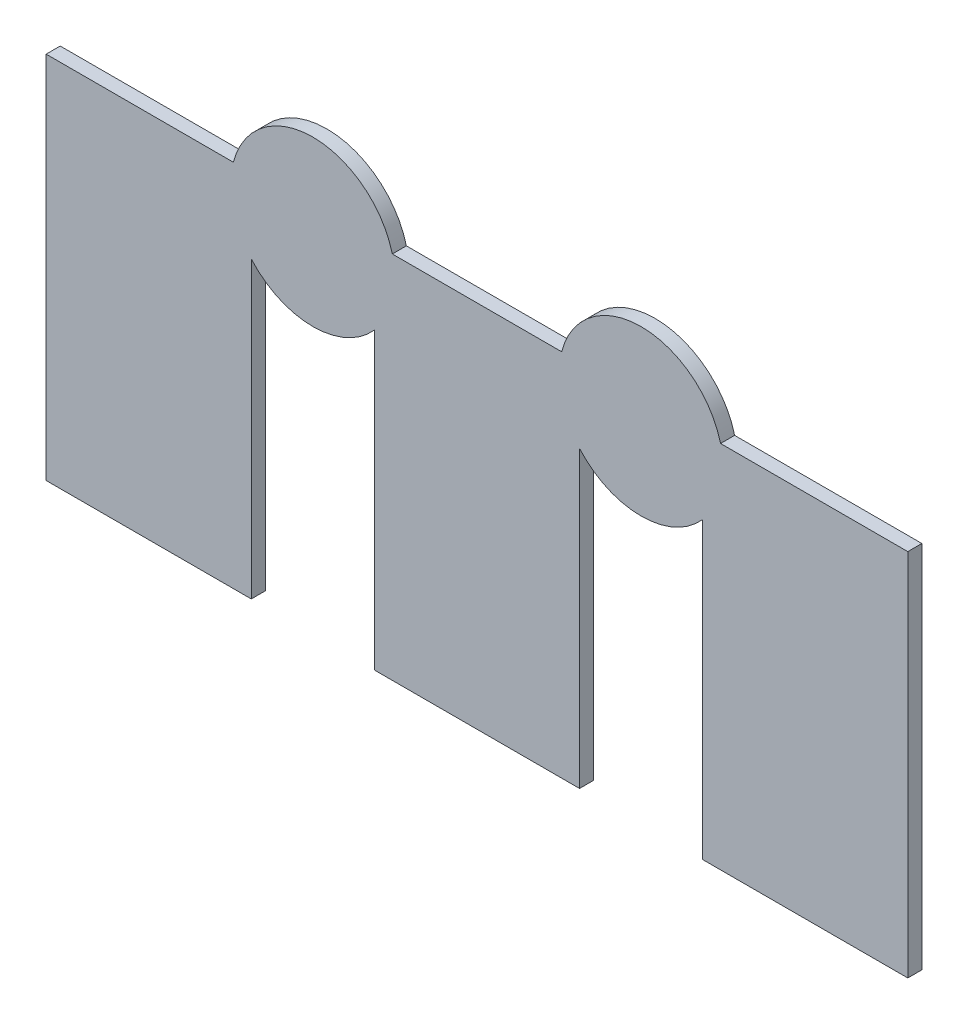
ISO-10303-21;
HEADER;
FILE_DESCRIPTION(('STEP AP214'),'2;1');
FILE_NAME('part.step','',(''),(''),'','','');
FILE_SCHEMA(('AUTOMOTIVE_DESIGN { 1 0 10303 214 1 1 1 1 }'));
ENDSEC;
DATA;
#1=APPLICATION_CONTEXT('core data for automotive mechanical design processes');
#2=APPLICATION_PROTOCOL_DEFINITION('international standard','automotive_design',2000,#1);
#3=PRODUCT_CONTEXT('',#1,'mechanical');
#4=PRODUCT('Part','Part','',(#3));
#5=PRODUCT_RELATED_PRODUCT_CATEGORY('part','',(#4));
#6=PRODUCT_DEFINITION_FORMATION('','',#4);
#7=PRODUCT_DEFINITION_CONTEXT('part definition',#1,'design');
#8=PRODUCT_DEFINITION('design','',#6,#7);
#9=PRODUCT_DEFINITION_SHAPE('','',#8);
#10=(LENGTH_UNIT() NAMED_UNIT(*) SI_UNIT(.MILLI.,.METRE.));
#11=(NAMED_UNIT(*) PLANE_ANGLE_UNIT() SI_UNIT($,.RADIAN.));
#12=(NAMED_UNIT(*) SI_UNIT($,.STERADIAN.) SOLID_ANGLE_UNIT());
#13=UNCERTAINTY_MEASURE_WITH_UNIT(LENGTH_MEASURE(1.E-05),#10,'distance_accuracy_value','');
#14=(GEOMETRIC_REPRESENTATION_CONTEXT(3) GLOBAL_UNCERTAINTY_ASSIGNED_CONTEXT((#13)) GLOBAL_UNIT_ASSIGNED_CONTEXT((#10,
#11,#12)) REPRESENTATION_CONTEXT('',''));
#15=CARTESIAN_POINT('',(0.,0.,0.));
#16=DIRECTION('',(0.,0.,1.));
#17=DIRECTION('',(1.,0.,0.));
#18=AXIS2_PLACEMENT_3D('',#15,#16,#17);
#19=CARTESIAN_POINT('',(4.200079999771,10.541256410265,0.));
#20=DIRECTION('',(0.,0.,-1.));
#21=DIRECTION('',(-1.,0.,0.));
#22=AXIS2_PLACEMENT_3D('',#19,#20,#21);
#23=PLANE('',#22);
#24=DIRECTION('',(1.,0.,0.));
#25=VECTOR('',#24,1.);
#26=CARTESIAN_POINT('',(4.793754643,10.95,0.));
#27=LINE('',#26,#25);
#28=CARTESIAN_POINT('',(4.79375464300021,10.95,0.));
#29=VERTEX_POINT('',#28);
#30=CARTESIAN_POINT('',(5.25008,10.95,0.));
#31=VERTEX_POINT('',#30);
#32=EDGE_CURVE('E93',#29,#31,#27,.T.);
#33=ORIENTED_EDGE('',*,*,#32,.T.);
#34=DIRECTION('',(0.,1.,0.));
#35=VECTOR('',#34,1.);
#36=CARTESIAN_POINT('',(5.25008,10.95,0.));
#37=LINE('',#36,#35);
#38=CARTESIAN_POINT('',(5.25008,10.05,0.));
#39=VERTEX_POINT('',#38);
#40=EDGE_CURVE('E112',#31,#39,#37,.F.);
#41=ORIENTED_EDGE('',*,*,#40,.T.);
#42=DIRECTION('',(1.,0.,0.));
#43=VECTOR('',#42,1.);
#44=CARTESIAN_POINT('',(5.25008,10.05,0.));
#45=LINE('',#44,#43);
#46=CARTESIAN_POINT('',(4.75008,10.05,0.));
#47=VERTEX_POINT('',#46);
#48=EDGE_CURVE('E107',#39,#47,#45,.F.);
#49=ORIENTED_EDGE('',*,*,#48,.T.);
#50=DIRECTION('',(0.,1.,0.));
#51=VECTOR('',#50,1.);
#52=CARTESIAN_POINT('',(4.75008,10.05,0.));
#53=LINE('',#52,#51);
#54=CARTESIAN_POINT('',(4.75008,10.7676751440001,0.));
#55=VERTEX_POINT('',#54);
#56=EDGE_CURVE('E111',#47,#55,#53,.T.);
#57=ORIENTED_EDGE('',*,*,#56,.T.);
#58=CARTESIAN_POINT('',(4.60008,10.899999999596,0.));
#59=DIRECTION('',(0.,0.,1.));
#60=DIRECTION('',(1.,0.,0.));
#61=AXIS2_PLACEMENT_3D('',#58,#59,#60);
#62=CIRCLE('',#61,0.200024667);
#63=CARTESIAN_POINT('',(4.45008000000004,10.7676751440001,0.));
#64=VERTEX_POINT('',#63);
#65=EDGE_CURVE('E124',#64,#55,#62,.T.);
#66=ORIENTED_EDGE('',*,*,#65,.F.);
#67=DIRECTION('',(0.,1.,0.));
#68=VECTOR('',#67,1.);
#69=CARTESIAN_POINT('',(4.45008,10.767675144,0.));
#70=LINE('',#69,#68);
#71=CARTESIAN_POINT('',(4.45008,10.05,0.));
#72=VERTEX_POINT('',#71);
#73=EDGE_CURVE('E137',#64,#72,#70,.F.);
#74=ORIENTED_EDGE('',*,*,#73,.T.);
#75=DIRECTION('',(1.,0.,0.));
#76=VECTOR('',#75,1.);
#77=CARTESIAN_POINT('',(4.45008,10.05,0.));
#78=LINE('',#77,#76);
#79=CARTESIAN_POINT('',(3.95008,10.05,0.));
#80=VERTEX_POINT('',#79);
#81=EDGE_CURVE('E144',#72,#80,#78,.F.);
#82=ORIENTED_EDGE('',*,*,#81,.T.);
#83=DIRECTION('',(0.,1.,0.));
#84=VECTOR('',#83,1.);
#85=CARTESIAN_POINT('',(3.95008,10.05,0.));
#86=LINE('',#85,#84);
#87=CARTESIAN_POINT('',(3.95008,10.7676751510001,0.));
#88=VERTEX_POINT('',#87);
#89=EDGE_CURVE('E150',#80,#88,#86,.T.);
#90=ORIENTED_EDGE('',*,*,#89,.T.);
#91=CARTESIAN_POINT('',(3.80008,10.900000006596,0.));
#92=DIRECTION('',(0.,0.,1.));
#93=DIRECTION('',(1.,0.,0.));
#94=AXIS2_PLACEMENT_3D('',#91,#92,#93);
#95=CIRCLE('',#94,0.200024667);
#96=CARTESIAN_POINT('',(3.65008000000004,10.7676751510001,0.));
#97=VERTEX_POINT('',#96);
#98=EDGE_CURVE('E152',#97,#88,#95,.T.);
#99=ORIENTED_EDGE('',*,*,#98,.F.);
#100=DIRECTION('',(0.,1.,0.));
#101=VECTOR('',#100,1.);
#102=CARTESIAN_POINT('',(3.65008,10.767675151,0.));
#103=LINE('',#102,#101);
#104=CARTESIAN_POINT('',(3.65008,10.05,0.));
#105=VERTEX_POINT('',#104);
#106=EDGE_CURVE('E155',#97,#105,#103,.F.);
#107=ORIENTED_EDGE('',*,*,#106,.T.);
#108=DIRECTION('',(1.,0.,0.));
#109=VECTOR('',#108,1.);
#110=CARTESIAN_POINT('',(3.65008,10.05,0.));
#111=LINE('',#110,#109);
#112=CARTESIAN_POINT('',(3.15008,10.05,0.));
#113=VERTEX_POINT('',#112);
#114=EDGE_CURVE('E162',#105,#113,#111,.F.);
#115=ORIENTED_EDGE('',*,*,#114,.T.);
#116=DIRECTION('',(0.,1.,0.));
#117=VECTOR('',#116,1.);
#118=CARTESIAN_POINT('',(3.15008,10.05,0.));
#119=LINE('',#118,#117);
#120=CARTESIAN_POINT('',(3.15008,10.95,0.));
#121=VERTEX_POINT('',#120);
#122=EDGE_CURVE('E168',#113,#121,#119,.T.);
#123=ORIENTED_EDGE('',*,*,#122,.T.);
#124=DIRECTION('',(1.,8.765680075471E-09,0.));
#125=VECTOR('',#124,1.);
#126=CARTESIAN_POINT('',(3.15008,10.95,0.));
#127=LINE('',#126,#125);
#128=CARTESIAN_POINT('',(3.60640535899979,10.950000004,0.));
#129=VERTEX_POINT('',#128);
#130=EDGE_CURVE('E174',#121,#129,#127,.T.);
#131=ORIENTED_EDGE('',*,*,#130,.T.);
#132=CARTESIAN_POINT('',(3.800079999967,10.899999995454,0.));
#133=DIRECTION('',(0.,0.,1.));
#134=DIRECTION('',(1.,0.,0.));
#135=AXIS2_PLACEMENT_3D('',#132,#133,#134);
#136=CIRCLE('',#135,0.200024667);
#137=CARTESIAN_POINT('',(3.99375464203164,10.94999999975,0.));
#138=VERTEX_POINT('',#137);
#139=EDGE_CURVE('E176',#138,#129,#136,.T.);
#140=ORIENTED_EDGE('',*,*,#139,.F.);
#141=DIRECTION('',(1.,1.029912388186E-08,0.));
#142=VECTOR('',#141,1.);
#143=CARTESIAN_POINT('',(3.993754642032,10.94999999975,0.));
#144=LINE('',#143,#142);
#145=CARTESIAN_POINT('',(4.40640535800021,10.9500000039999,0.));
#146=VERTEX_POINT('',#145);
#147=EDGE_CURVE('E179',#138,#146,#144,.T.);
#148=ORIENTED_EDGE('',*,*,#147,.T.);
#149=CARTESIAN_POINT('',(4.600079999984,10.89999999939,0.));
#150=DIRECTION('',(0.,0.,1.));
#151=DIRECTION('',(1.,0.,0.));
#152=AXIS2_PLACEMENT_3D('',#149,#150,#151);
#153=CIRCLE('',#152,0.200024667);
#154=EDGE_CURVE('E20',#29,#146,#153,.T.);
#155=ORIENTED_EDGE('',*,*,#154,.F.);
#156=EDGE_LOOP('',(#33,#41,#49,#57,#66,#74,#82,#90,#99,#107,#115,#123,#131,#140,#148,#155));
#157=FACE_BOUND('',#156,.T.);
#158=ADVANCED_FACE('F17',(#157),#23,.T.);
#159=CARTESIAN_POINT('',(5.25008,10.05,0.));
#160=DIRECTION('',(0.,1.,0.));
#161=DIRECTION('',(0.,0.,1.));
#162=AXIS2_PLACEMENT_3D('',#159,#160,#161);
#163=PLANE('',#162);
#164=DIRECTION('',(0.,0.,-1.));
#165=VECTOR('',#164,1.);
#166=CARTESIAN_POINT('',(4.75008,10.05,0.));
#167=LINE('',#166,#165);
#168=CARTESIAN_POINT('',(4.75008,10.05,0.03429));
#169=VERTEX_POINT('',#168);
#170=EDGE_CURVE('E119',#169,#47,#167,.T.);
#171=ORIENTED_EDGE('',*,*,#170,.T.);
#172=ORIENTED_EDGE('',*,*,#48,.F.);
#173=DIRECTION('',(0.,0.,1.));
#174=VECTOR('',#173,1.);
#175=CARTESIAN_POINT('',(5.25008,10.05,0.));
#176=LINE('',#175,#174);
#177=CARTESIAN_POINT('',(5.25008,10.05,0.03429));
#178=VERTEX_POINT('',#177);
#179=EDGE_CURVE('E184',#39,#178,#176,.T.);
#180=ORIENTED_EDGE('',*,*,#179,.T.);
#181=DIRECTION('',(1.,0.,0.));
#182=VECTOR('',#181,1.);
#183=CARTESIAN_POINT('',(4.200079999771,10.05,0.03429));
#184=LINE('',#183,#182);
#185=EDGE_CURVE('E122',#169,#178,#184,.T.);
#186=ORIENTED_EDGE('',*,*,#185,.F.);
#187=EDGE_LOOP('',(#171,#172,#180,#186));
#188=FACE_BOUND('',#187,.T.);
#189=ADVANCED_FACE('F120',(#188),#163,.F.);
#190=CARTESIAN_POINT('',(5.25008,10.95,0.));
#191=DIRECTION('',(-1.,0.,0.));
#192=DIRECTION('',(0.,0.,1.));
#193=AXIS2_PLACEMENT_3D('',#190,#191,#192);
#194=PLANE('',#193);
#195=ORIENTED_EDGE('',*,*,#179,.F.);
#196=ORIENTED_EDGE('',*,*,#40,.F.);
#197=DIRECTION('',(0.,0.,-1.));
#198=VECTOR('',#197,1.);
#199=CARTESIAN_POINT('',(5.25008,10.95,0.));
#200=LINE('',#199,#198);
#201=CARTESIAN_POINT('',(5.25008,10.95,0.03429));
#202=VERTEX_POINT('',#201);
#203=EDGE_CURVE('E183',#31,#202,#200,.F.);
#204=ORIENTED_EDGE('',*,*,#203,.T.);
#205=DIRECTION('',(0.,1.,0.));
#206=VECTOR('',#205,1.);
#207=CARTESIAN_POINT('',(5.25008,10.541256410265,0.03429));
#208=LINE('',#207,#206);
#209=EDGE_CURVE('E230',#178,#202,#208,.T.);
#210=ORIENTED_EDGE('',*,*,#209,.F.);
#211=EDGE_LOOP('',(#195,#196,#204,#210));
#212=FACE_BOUND('',#211,.T.);
#213=ADVANCED_FACE('F236',(#212),#194,.F.);
#214=CARTESIAN_POINT('',(4.793754643,10.95,0.));
#215=DIRECTION('',(0.,-1.,0.));
#216=DIRECTION('',(0.,0.,-1.));
#217=AXIS2_PLACEMENT_3D('',#214,#215,#216);
#218=PLANE('',#217);
#219=ORIENTED_EDGE('',*,*,#203,.F.);
#220=ORIENTED_EDGE('',*,*,#32,.F.);
#221=DIRECTION('',(0.,0.,1.));
#222=VECTOR('',#221,1.);
#223=CARTESIAN_POINT('',(4.79375464300021,10.9500000000001,0.));
#224=LINE('',#223,#222);
#225=CARTESIAN_POINT('',(4.79375464300021,10.95,0.03429));
#226=VERTEX_POINT('',#225);
#227=EDGE_CURVE('E223',#226,#29,#224,.F.);
#228=ORIENTED_EDGE('',*,*,#227,.F.);
#229=DIRECTION('',(1.,0.,0.));
#230=VECTOR('',#229,1.);
#231=CARTESIAN_POINT('',(4.200079999771,10.95,0.03429));
#232=LINE('',#231,#230);
#233=EDGE_CURVE('E206',#202,#226,#232,.F.);
#234=ORIENTED_EDGE('',*,*,#233,.F.);
#235=EDGE_LOOP('',(#219,#220,#228,#234));
#236=FACE_BOUND('',#235,.T.);
#237=ADVANCED_FACE('F311',(#236),#218,.F.);
#238=CARTESIAN_POINT('',(4.600079999984,10.89999999939,0.));
#239=DIRECTION('',(0.,0.,1.));
#240=DIRECTION('',(1.,0.,0.));
#241=AXIS2_PLACEMENT_3D('',#238,#239,#240);
#242=CYLINDRICAL_SURFACE('',#241,0.200024667);
#243=ORIENTED_EDGE('',*,*,#154,.T.);
#244=DIRECTION('',(0.,0.,1.));
#245=VECTOR('',#244,1.);
#246=CARTESIAN_POINT('',(4.406405358,10.9500000039999,0.));
#247=LINE('',#246,#245);
#248=CARTESIAN_POINT('',(4.40640535800022,10.950000004,0.03429));
#249=VERTEX_POINT('',#248);
#250=EDGE_CURVE('E181',#146,#249,#247,.T.);
#251=ORIENTED_EDGE('',*,*,#250,.T.);
#252=CARTESIAN_POINT('',(4.600079999984,10.89999999939,0.03429));
#253=DIRECTION('',(0.,0.,1.));
#254=DIRECTION('',(1.,0.,0.));
#255=AXIS2_PLACEMENT_3D('',#252,#253,#254);
#256=CIRCLE('',#255,0.200024667);
#257=EDGE_CURVE('E203',#226,#249,#256,.T.);
#258=ORIENTED_EDGE('',*,*,#257,.F.);
#259=ORIENTED_EDGE('',*,*,#227,.T.);
#260=EDGE_LOOP('',(#243,#251,#258,#259));
#261=FACE_BOUND('',#260,.T.);
#262=ADVANCED_FACE('F464',(#261),#242,.T.);
#263=CARTESIAN_POINT('',(3.993754642032,10.94999999975,0.));
#264=DIRECTION('',(1.029912388186E-08,-1.,0.));
#265=DIRECTION('',(1.,1.029912388186E-08,0.));
#266=AXIS2_PLACEMENT_3D('',#263,#264,#265);
#267=PLANE('',#266);
#268=ORIENTED_EDGE('',*,*,#250,.F.);
#269=ORIENTED_EDGE('',*,*,#147,.F.);
#270=DIRECTION('',(0.,0.,1.));
#271=VECTOR('',#270,1.);
#272=CARTESIAN_POINT('',(3.99375464203165,10.9499999997499,0.));
#273=LINE('',#272,#271);
#274=CARTESIAN_POINT('',(3.99375464148304,10.950000001875,0.03429));
#275=VERTEX_POINT('',#274);
#276=EDGE_CURVE('E212',#275,#138,#273,.F.);
#277=ORIENTED_EDGE('',*,*,#276,.F.);
#278=DIRECTION('',(1.,0.,0.));
#279=VECTOR('',#278,1.);
#280=CARTESIAN_POINT('',(4.200079999771,10.950000004,0.03429));
#281=LINE('',#280,#279);
#282=EDGE_CURVE('E202',#249,#275,#281,.F.);
#283=ORIENTED_EDGE('',*,*,#282,.F.);
#284=EDGE_LOOP('',(#268,#269,#277,#283));
#285=FACE_BOUND('',#284,.T.);
#286=ADVANCED_FACE('F455',(#285),#267,.F.);
#287=CARTESIAN_POINT('',(3.800079999967,10.899999995454,0.));
#288=DIRECTION('',(0.,0.,1.));
#289=DIRECTION('',(1.,0.,0.));
#290=AXIS2_PLACEMENT_3D('',#287,#288,#289);
#291=CYLINDRICAL_SURFACE('',#290,0.200024667);
#292=ORIENTED_EDGE('',*,*,#139,.T.);
#293=DIRECTION('',(0.,0.,1.));
#294=VECTOR('',#293,1.);
#295=CARTESIAN_POINT('',(3.606405359,10.950000004,0.));
#296=LINE('',#295,#294);
#297=CARTESIAN_POINT('',(3.60640535899979,10.950000004,0.03429));
#298=VERTEX_POINT('',#297);
#299=EDGE_CURVE('E171',#129,#298,#296,.T.);
#300=ORIENTED_EDGE('',*,*,#299,.T.);
#301=CARTESIAN_POINT('',(3.800079999967,10.899999995454,0.03429));
#302=DIRECTION('',(0.,0.,1.));
#303=DIRECTION('',(1.,0.,0.));
#304=AXIS2_PLACEMENT_3D('',#301,#302,#303);
#305=CIRCLE('',#304,0.200024667);
#306=EDGE_CURVE('E198',#275,#298,#305,.T.);
#307=ORIENTED_EDGE('',*,*,#306,.F.);
#308=ORIENTED_EDGE('',*,*,#276,.T.);
#309=EDGE_LOOP('',(#292,#300,#307,#308));
#310=FACE_BOUND('',#309,.T.);
#311=ADVANCED_FACE('F446',(#310),#291,.T.);
#312=CARTESIAN_POINT('',(3.15008,10.95,0.));
#313=DIRECTION('',(8.765680075471E-09,-1.,0.));
#314=DIRECTION('',(1.,8.765680075471E-09,0.));
#315=AXIS2_PLACEMENT_3D('',#312,#313,#314);
#316=PLANE('',#315);
#317=ORIENTED_EDGE('',*,*,#299,.F.);
#318=ORIENTED_EDGE('',*,*,#130,.F.);
#319=DIRECTION('',(0.,0.,-1.));
#320=VECTOR('',#319,1.);
#321=CARTESIAN_POINT('',(3.15008,10.95,0.));
#322=LINE('',#321,#320);
#323=CARTESIAN_POINT('',(3.15008,10.9500000026667,0.03429));
#324=VERTEX_POINT('',#323);
#325=EDGE_CURVE('E165',#121,#324,#322,.F.);
#326=ORIENTED_EDGE('',*,*,#325,.T.);
#327=DIRECTION('',(1.,0.,0.));
#328=VECTOR('',#327,1.);
#329=CARTESIAN_POINT('',(4.200079999771,10.950000004,0.03429));
#330=LINE('',#329,#328);
#331=EDGE_CURVE('E201',#298,#324,#330,.F.);
#332=ORIENTED_EDGE('',*,*,#331,.F.);
#333=EDGE_LOOP('',(#317,#318,#326,#332));
#334=FACE_BOUND('',#333,.T.);
#335=ADVANCED_FACE('F290',(#334),#316,.F.);
#336=CARTESIAN_POINT('',(3.15008,10.05,0.));
#337=DIRECTION('',(1.,0.,0.));
#338=DIRECTION('',(0.,0.,-1.));
#339=AXIS2_PLACEMENT_3D('',#336,#337,#338);
#340=PLANE('',#339);
#341=ORIENTED_EDGE('',*,*,#325,.F.);
#342=ORIENTED_EDGE('',*,*,#122,.F.);
#343=DIRECTION('',(0.,0.,1.));
#344=VECTOR('',#343,1.);
#345=CARTESIAN_POINT('',(3.15008,10.05,0.));
#346=LINE('',#345,#344);
#347=CARTESIAN_POINT('',(3.15008,10.05,0.03429));
#348=VERTEX_POINT('',#347);
#349=EDGE_CURVE('E159',#113,#348,#346,.T.);
#350=ORIENTED_EDGE('',*,*,#349,.T.);
#351=DIRECTION('',(0.,1.,0.));
#352=VECTOR('',#351,1.);
#353=CARTESIAN_POINT('',(3.15008,10.541256410265,0.03429));
#354=LINE('',#353,#352);
#355=EDGE_CURVE('E272',#324,#348,#354,.F.);
#356=ORIENTED_EDGE('',*,*,#355,.F.);
#357=EDGE_LOOP('',(#341,#342,#350,#356));
#358=FACE_BOUND('',#357,.T.);
#359=ADVANCED_FACE('F296',(#358),#340,.F.);
#360=CARTESIAN_POINT('',(3.65008,10.05,0.));
#361=DIRECTION('',(0.,1.,0.));
#362=DIRECTION('',(0.,0.,1.));
#363=AXIS2_PLACEMENT_3D('',#360,#361,#362);
#364=PLANE('',#363);
#365=ORIENTED_EDGE('',*,*,#349,.F.);
#366=ORIENTED_EDGE('',*,*,#114,.F.);
#367=DIRECTION('',(0.,0.,1.));
#368=VECTOR('',#367,1.);
#369=CARTESIAN_POINT('',(3.65008,10.05,0.));
#370=LINE('',#369,#368);
#371=CARTESIAN_POINT('',(3.65008,10.05,0.03429));
#372=VERTEX_POINT('',#371);
#373=EDGE_CURVE('E158',#105,#372,#370,.T.);
#374=ORIENTED_EDGE('',*,*,#373,.T.);
#375=DIRECTION('',(1.,0.,0.));
#376=VECTOR('',#375,1.);
#377=CARTESIAN_POINT('',(4.200079999771,10.05,0.03429));
#378=LINE('',#377,#376);
#379=EDGE_CURVE('E269',#348,#372,#378,.T.);
#380=ORIENTED_EDGE('',*,*,#379,.F.);
#381=EDGE_LOOP('',(#365,#366,#374,#380));
#382=FACE_BOUND('',#381,.T.);
#383=ADVANCED_FACE('F420',(#382),#364,.F.);
#384=CARTESIAN_POINT('',(3.65008,10.767675151,0.));
#385=DIRECTION('',(-1.,0.,0.));
#386=DIRECTION('',(0.,0.,1.));
#387=AXIS2_PLACEMENT_3D('',#384,#385,#386);
#388=PLANE('',#387);
#389=ORIENTED_EDGE('',*,*,#373,.F.);
#390=ORIENTED_EDGE('',*,*,#106,.F.);
#391=DIRECTION('',(0.,0.,1.));
#392=VECTOR('',#391,1.);
#393=CARTESIAN_POINT('',(3.65008000000008,10.7676751510001,0.));
#394=LINE('',#393,#392);
#395=CARTESIAN_POINT('',(3.65008000000004,10.7676751510001,0.03429));
#396=VERTEX_POINT('',#395);
#397=EDGE_CURVE('E210',#396,#97,#394,.F.);
#398=ORIENTED_EDGE('',*,*,#397,.F.);
#399=DIRECTION('',(0.,1.,0.));
#400=VECTOR('',#399,1.);
#401=CARTESIAN_POINT('',(3.65008,10.541256410265,0.03429));
#402=LINE('',#401,#400);
#403=EDGE_CURVE('E197',#372,#396,#402,.T.);
#404=ORIENTED_EDGE('',*,*,#403,.F.);
#405=EDGE_LOOP('',(#389,#390,#398,#404));
#406=FACE_BOUND('',#405,.T.);
#407=ADVANCED_FACE('F348',(#406),#388,.F.);
#408=CARTESIAN_POINT('',(3.80008,10.900000006596,0.));
#409=DIRECTION('',(0.,0.,1.));
#410=DIRECTION('',(1.,0.,0.));
#411=AXIS2_PLACEMENT_3D('',#408,#409,#410);
#412=CYLINDRICAL_SURFACE('',#411,0.200024667);
#413=ORIENTED_EDGE('',*,*,#98,.T.);
#414=DIRECTION('',(0.,0.,-1.));
#415=VECTOR('',#414,1.);
#416=CARTESIAN_POINT('',(3.95008,10.767675151,0.));
#417=LINE('',#416,#415);
#418=CARTESIAN_POINT('',(3.95008,10.7676751510001,0.03429));
#419=VERTEX_POINT('',#418);
#420=EDGE_CURVE('E147',#88,#419,#417,.F.);
#421=ORIENTED_EDGE('',*,*,#420,.T.);
#422=CARTESIAN_POINT('',(3.80008,10.900000006596,0.03429));
#423=DIRECTION('',(0.,0.,1.));
#424=DIRECTION('',(1.,0.,0.));
#425=AXIS2_PLACEMENT_3D('',#422,#423,#424);
#426=CIRCLE('',#425,0.200024667);
#427=EDGE_CURVE('E193',#396,#419,#426,.T.);
#428=ORIENTED_EDGE('',*,*,#427,.F.);
#429=ORIENTED_EDGE('',*,*,#397,.T.);
#430=EDGE_LOOP('',(#413,#421,#428,#429));
#431=FACE_BOUND('',#430,.T.);
#432=ADVANCED_FACE('F351',(#431),#412,.T.);
#433=CARTESIAN_POINT('',(3.95008,10.05,0.));
#434=DIRECTION('',(1.,0.,0.));
#435=DIRECTION('',(0.,0.,-1.));
#436=AXIS2_PLACEMENT_3D('',#433,#434,#435);
#437=PLANE('',#436);
#438=ORIENTED_EDGE('',*,*,#420,.F.);
#439=ORIENTED_EDGE('',*,*,#89,.F.);
#440=DIRECTION('',(0.,0.,1.));
#441=VECTOR('',#440,1.);
#442=CARTESIAN_POINT('',(3.95008,10.05,0.));
#443=LINE('',#442,#441);
#444=CARTESIAN_POINT('',(3.95008,10.05,0.03429));
#445=VERTEX_POINT('',#444);
#446=EDGE_CURVE('E141',#80,#445,#443,.T.);
#447=ORIENTED_EDGE('',*,*,#446,.T.);
#448=DIRECTION('',(0.,1.,0.));
#449=VECTOR('',#448,1.);
#450=CARTESIAN_POINT('',(3.95008,10.541256410265,0.03429));
#451=LINE('',#450,#449);
#452=EDGE_CURVE('E196',#419,#445,#451,.F.);
#453=ORIENTED_EDGE('',*,*,#452,.F.);
#454=EDGE_LOOP('',(#438,#439,#447,#453));
#455=FACE_BOUND('',#454,.T.);
#456=ADVANCED_FACE('F353',(#455),#437,.F.);
#457=CARTESIAN_POINT('',(4.45008,10.05,0.));
#458=DIRECTION('',(0.,1.,0.));
#459=DIRECTION('',(0.,0.,1.));
#460=AXIS2_PLACEMENT_3D('',#457,#458,#459);
#461=PLANE('',#460);
#462=ORIENTED_EDGE('',*,*,#446,.F.);
#463=ORIENTED_EDGE('',*,*,#81,.F.);
#464=DIRECTION('',(0.,0.,1.));
#465=VECTOR('',#464,1.);
#466=CARTESIAN_POINT('',(4.45008,10.05,0.));
#467=LINE('',#466,#465);
#468=CARTESIAN_POINT('',(4.45008,10.05,0.03429));
#469=VERTEX_POINT('',#468);
#470=EDGE_CURVE('E140',#72,#469,#467,.T.);
#471=ORIENTED_EDGE('',*,*,#470,.T.);
#472=DIRECTION('',(1.,0.,0.));
#473=VECTOR('',#472,1.);
#474=CARTESIAN_POINT('',(4.200079999771,10.05,0.03429));
#475=LINE('',#474,#473);
#476=EDGE_CURVE('E253',#445,#469,#475,.T.);
#477=ORIENTED_EDGE('',*,*,#476,.F.);
#478=EDGE_LOOP('',(#462,#463,#471,#477));
#479=FACE_BOUND('',#478,.T.);
#480=ADVANCED_FACE('F329',(#479),#461,.F.);
#481=CARTESIAN_POINT('',(4.45008,10.767675144,0.));
#482=DIRECTION('',(-1.,0.,0.));
#483=DIRECTION('',(0.,0.,1.));
#484=AXIS2_PLACEMENT_3D('',#481,#482,#483);
#485=PLANE('',#484);
#486=ORIENTED_EDGE('',*,*,#470,.F.);
#487=ORIENTED_EDGE('',*,*,#73,.F.);
#488=DIRECTION('',(0.,0.,1.));
#489=VECTOR('',#488,1.);
#490=CARTESIAN_POINT('',(4.45008000000008,10.7676751440001,0.));
#491=LINE('',#490,#489);
#492=CARTESIAN_POINT('',(4.45008000000004,10.7676751440001,0.03429));
#493=VERTEX_POINT('',#492);
#494=EDGE_CURVE('E208',#493,#64,#491,.F.);
#495=ORIENTED_EDGE('',*,*,#494,.F.);
#496=DIRECTION('',(0.,1.,0.));
#497=VECTOR('',#496,1.);
#498=CARTESIAN_POINT('',(4.45008,10.541256410265,0.03429));
#499=LINE('',#498,#497);
#500=EDGE_CURVE('E192',#469,#493,#499,.T.);
#501=ORIENTED_EDGE('',*,*,#500,.F.);
#502=EDGE_LOOP('',(#486,#487,#495,#501));
#503=FACE_BOUND('',#502,.T.);
#504=ADVANCED_FACE('F333',(#503),#485,.F.);
#505=CARTESIAN_POINT('',(4.60008,10.899999999596,0.));
#506=DIRECTION('',(0.,0.,1.));
#507=DIRECTION('',(1.,0.,0.));
#508=AXIS2_PLACEMENT_3D('',#505,#506,#507);
#509=CYLINDRICAL_SURFACE('',#508,0.200024667);
#510=ORIENTED_EDGE('',*,*,#65,.T.);
#511=DIRECTION('',(0.,0.,-1.));
#512=VECTOR('',#511,1.);
#513=CARTESIAN_POINT('',(4.75008,10.767675144,0.));
#514=LINE('',#513,#512);
#515=CARTESIAN_POINT('',(4.75008,10.7676751440001,0.03429));
#516=VERTEX_POINT('',#515);
#517=EDGE_CURVE('E35',#55,#516,#514,.F.);
#518=ORIENTED_EDGE('',*,*,#517,.T.);
#519=CARTESIAN_POINT('',(4.60008,10.899999999596,0.03429));
#520=DIRECTION('',(0.,0.,1.));
#521=DIRECTION('',(1.,0.,0.));
#522=AXIS2_PLACEMENT_3D('',#519,#520,#521);
#523=CIRCLE('',#522,0.200024667);
#524=EDGE_CURVE('E26',#493,#516,#523,.T.);
#525=ORIENTED_EDGE('',*,*,#524,.F.);
#526=ORIENTED_EDGE('',*,*,#494,.T.);
#527=EDGE_LOOP('',(#510,#518,#525,#526));
#528=FACE_BOUND('',#527,.T.);
#529=ADVANCED_FACE('F354',(#528),#509,.T.);
#530=CARTESIAN_POINT('',(4.75008,10.05,0.));
#531=DIRECTION('',(1.,0.,0.));
#532=DIRECTION('',(0.,0.,-1.));
#533=AXIS2_PLACEMENT_3D('',#530,#531,#532);
#534=PLANE('',#533);
#535=ORIENTED_EDGE('',*,*,#517,.F.);
#536=ORIENTED_EDGE('',*,*,#56,.F.);
#537=ORIENTED_EDGE('',*,*,#170,.F.);
#538=DIRECTION('',(0.,1.,0.));
#539=VECTOR('',#538,1.);
#540=CARTESIAN_POINT('',(4.75008,10.541256410265,0.03429));
#541=LINE('',#540,#539);
#542=EDGE_CURVE('E11',#516,#169,#541,.F.);
#543=ORIENTED_EDGE('',*,*,#542,.F.);
#544=EDGE_LOOP('',(#535,#536,#537,#543));
#545=FACE_BOUND('',#544,.T.);
#546=ADVANCED_FACE('F126',(#545),#534,.F.);
#547=CARTESIAN_POINT('',(4.200079999771,10.541256410265,0.03429));
#548=DIRECTION('',(0.,0.,1.));
#549=DIRECTION('',(1.,0.,0.));
#550=AXIS2_PLACEMENT_3D('',#547,#548,#549);
#551=PLANE('',#550);
#552=ORIENTED_EDGE('',*,*,#524,.T.);
#553=ORIENTED_EDGE('',*,*,#542,.T.);
#554=ORIENTED_EDGE('',*,*,#185,.T.);
#555=ORIENTED_EDGE('',*,*,#209,.T.);
#556=ORIENTED_EDGE('',*,*,#233,.T.);
#557=ORIENTED_EDGE('',*,*,#257,.T.);
#558=ORIENTED_EDGE('',*,*,#282,.T.);
#559=ORIENTED_EDGE('',*,*,#306,.T.);
#560=ORIENTED_EDGE('',*,*,#331,.T.);
#561=ORIENTED_EDGE('',*,*,#355,.T.);
#562=ORIENTED_EDGE('',*,*,#379,.T.);
#563=ORIENTED_EDGE('',*,*,#403,.T.);
#564=ORIENTED_EDGE('',*,*,#427,.T.);
#565=ORIENTED_EDGE('',*,*,#452,.T.);
#566=ORIENTED_EDGE('',*,*,#476,.T.);
#567=ORIENTED_EDGE('',*,*,#500,.T.);
#568=EDGE_LOOP('',(#552,#553,#554,#555,#556,#557,#558,#559,#560,#561,#562,#563,#564,#565,#566,#567));
#569=FACE_BOUND('',#568,.T.);
#570=ADVANCED_FACE('F240',(#569),#551,.T.);
#571=CLOSED_SHELL('',(#158,#189,#213,#237,#262,#286,#311,#335,#359,#383,#407,#432,#456,#480,
#504,#529,#546,#570));
#572=MANIFOLD_SOLID_BREP('B1',#571);
#573=ADVANCED_BREP_SHAPE_REPRESENTATION('',(#18,#572),#14);
#574=SHAPE_DEFINITION_REPRESENTATION(#9,#573);
ENDSEC;
END-ISO-10303-21;
